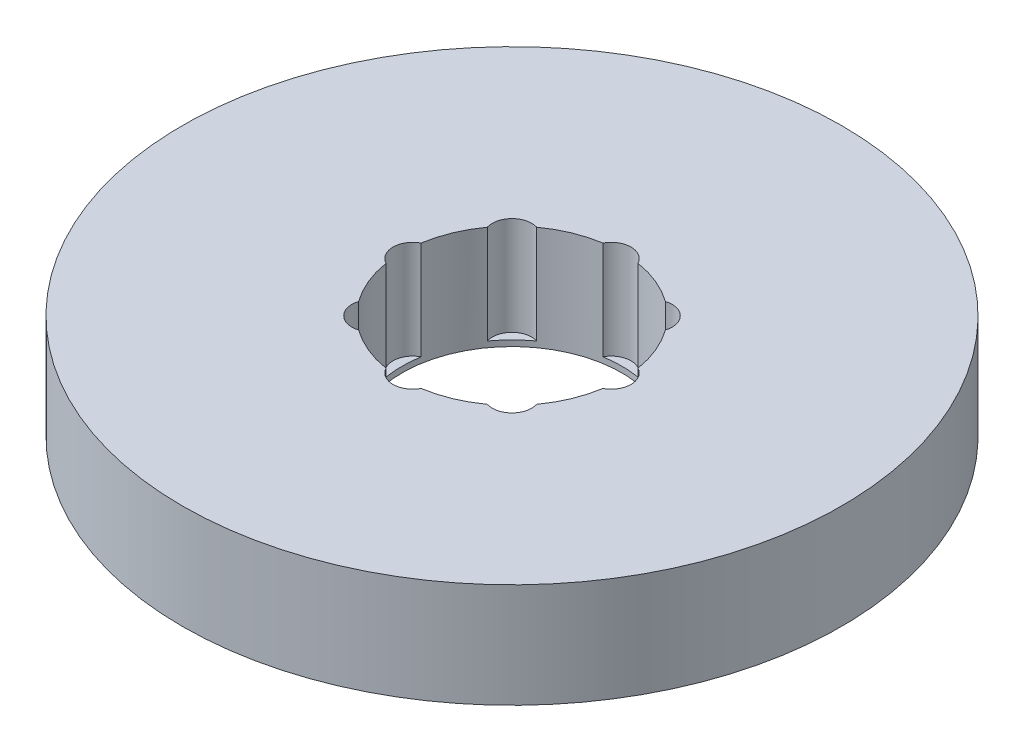
ISO-10303-21;
HEADER;
FILE_DESCRIPTION(('STEP AP214'),'2;1');
FILE_NAME('part.step','',(''),(''),'','','');
FILE_SCHEMA(('AUTOMOTIVE_DESIGN { 1 0 10303 214 1 1 1 1 }'));
ENDSEC;
DATA;
#1=APPLICATION_CONTEXT('core data for automotive mechanical design processes');
#2=APPLICATION_PROTOCOL_DEFINITION('international standard','automotive_design',2000,#1);
#3=PRODUCT_CONTEXT('',#1,'mechanical');
#4=PRODUCT('Part','Part','',(#3));
#5=PRODUCT_RELATED_PRODUCT_CATEGORY('part','',(#4));
#6=PRODUCT_DEFINITION_FORMATION('','',#4);
#7=PRODUCT_DEFINITION_CONTEXT('part definition',#1,'design');
#8=PRODUCT_DEFINITION('design','',#6,#7);
#9=PRODUCT_DEFINITION_SHAPE('','',#8);
#10=(LENGTH_UNIT() NAMED_UNIT(*) SI_UNIT(.MILLI.,.METRE.));
#11=(NAMED_UNIT(*) PLANE_ANGLE_UNIT() SI_UNIT($,.RADIAN.));
#12=(NAMED_UNIT(*) SI_UNIT($,.STERADIAN.) SOLID_ANGLE_UNIT());
#13=UNCERTAINTY_MEASURE_WITH_UNIT(LENGTH_MEASURE(1.E-05),#10,'distance_accuracy_value','');
#14=(GEOMETRIC_REPRESENTATION_CONTEXT(3) GLOBAL_UNCERTAINTY_ASSIGNED_CONTEXT((#13)) GLOBAL_UNIT_ASSIGNED_CONTEXT((#10,
#11,#12)) REPRESENTATION_CONTEXT('',''));
#15=CARTESIAN_POINT('',(0.,0.,0.));
#16=DIRECTION('',(0.,0.,1.));
#17=DIRECTION('',(1.,0.,0.));
#18=AXIS2_PLACEMENT_3D('',#15,#16,#17);
#19=CARTESIAN_POINT('',(0.,19.,0.));
#20=DIRECTION('',(0.,-1.,0.));
#21=DIRECTION('',(0.,0.,-1.));
#22=AXIS2_PLACEMENT_3D('',#19,#20,#21);
#23=CYLINDRICAL_SURFACE('',#22,60.);
#24=CARTESIAN_POINT('',(0.,19.,0.));
#25=DIRECTION('',(0.,1.,0.));
#26=DIRECTION('',(0.,0.,1.));
#27=AXIS2_PLACEMENT_3D('',#24,#25,#26);
#28=CIRCLE('',#27,60.);
#29=CARTESIAN_POINT('',(0.,19.,60.));
#30=VERTEX_POINT('',#29);
#31=EDGE_CURVE('E183',#30,#30,#28,.T.);
#32=ORIENTED_EDGE('',*,*,#31,.F.);
#33=EDGE_LOOP('',(#32));
#34=FACE_BOUND('',#33,.T.);
#35=CARTESIAN_POINT('',(0.,0.,0.));
#36=DIRECTION('',(0.,1.,0.));
#37=DIRECTION('',(0.,0.,1.));
#38=AXIS2_PLACEMENT_3D('',#35,#36,#37);
#39=CIRCLE('',#38,60.);
#40=CARTESIAN_POINT('',(0.,0.,60.));
#41=VERTEX_POINT('',#40);
#42=EDGE_CURVE('E182',#41,#41,#39,.T.);
#43=ORIENTED_EDGE('',*,*,#42,.T.);
#44=EDGE_LOOP('',(#43));
#45=FACE_BOUND('',#44,.T.);
#46=ADVANCED_FACE('F39',(#34,#45),#23,.T.);
#47=CARTESIAN_POINT('',(0.,19.,0.));
#48=DIRECTION('',(0.,1.,0.));
#49=DIRECTION('',(0.,0.,1.));
#50=AXIS2_PLACEMENT_3D('',#47,#48,#49);
#51=PLANE('',#50);
#52=CARTESIAN_POINT('',(0.,19.,18.0656059440609));
#53=DIRECTION('',(0.,1.,0.));
#54=DIRECTION('',(1.,0.,0.));
#55=AXIS2_PLACEMENT_3D('',#52,#53,#54);
#56=CIRCLE('',#55,3.60046366302594);
#57=CARTESIAN_POINT('',(-3.18492036893539,19.,19.7447786071037));
#58=VERTEX_POINT('',#57);
#59=CARTESIAN_POINT('',(3.18492036893552,19.,19.7447786071037));
#60=VERTEX_POINT('',#59);
#61=EDGE_CURVE('E256',#58,#60,#56,.T.);
#62=ORIENTED_EDGE('',*,*,#61,.F.);
#63=CARTESIAN_POINT('',(0.,19.,0.));
#64=DIRECTION('',(0.,1.,0.));
#65=DIRECTION('',(0.,0.,1.));
#66=AXIS2_PLACEMENT_3D('',#63,#64,#65);
#67=CIRCLE('',#66,20.);
#68=CARTESIAN_POINT('',(-11.7095880556967,19.,16.2137456365235));
#69=VERTEX_POINT('',#68);
#70=EDGE_CURVE('E175',#69,#58,#67,.T.);
#71=ORIENTED_EDGE('',*,*,#70,.F.);
#72=CARTESIAN_POINT('',(-12.7743124692895,19.,12.7743124692895));
#73=DIRECTION('',(0.,1.,0.));
#74=DIRECTION('',(0.707106781186549,0.,0.707106781186546));
#75=AXIS2_PLACEMENT_3D('',#72,#73,#74);
#76=CIRCLE('',#75,3.60046366302594);
#77=CARTESIAN_POINT('',(-16.2137456365235,19.,11.7095880556967));
#78=VERTEX_POINT('',#77);
#79=EDGE_CURVE('E152',#78,#69,#76,.T.);
#80=ORIENTED_EDGE('',*,*,#79,.F.);
#81=CARTESIAN_POINT('',(-19.7447786071037,19.,3.18492036893545));
#82=VERTEX_POINT('',#81);
#83=EDGE_CURVE('E168',#82,#78,#67,.T.);
#84=ORIENTED_EDGE('',*,*,#83,.F.);
#85=CARTESIAN_POINT('',(-18.0656059440609,19.,0.));
#86=DIRECTION('',(0.,1.,0.));
#87=DIRECTION('',(0.,0.,1.));
#88=AXIS2_PLACEMENT_3D('',#85,#86,#87);
#89=CIRCLE('',#88,3.60046366302594);
#90=CARTESIAN_POINT('',(-19.7447786071037,19.,-3.18492036893545));
#91=VERTEX_POINT('',#90);
#92=EDGE_CURVE('E205',#91,#82,#89,.T.);
#93=ORIENTED_EDGE('',*,*,#92,.F.);
#94=CARTESIAN_POINT('',(-16.2137456365237,19.,-11.7095880556965));
#95=VERTEX_POINT('',#94);
#96=EDGE_CURVE('E181',#95,#91,#67,.T.);
#97=ORIENTED_EDGE('',*,*,#96,.F.);
#98=CARTESIAN_POINT('',(-12.7743124692896,19.,-12.7743124692893));
#99=DIRECTION('',(0.,1.,0.));
#100=DIRECTION('',(-0.707106781186539,0.,0.707106781186556));
#101=AXIS2_PLACEMENT_3D('',#98,#99,#100);
#102=CIRCLE('',#101,3.60046366302594);
#103=CARTESIAN_POINT('',(-11.7095880556969,19.,-16.2137456365234));
#104=VERTEX_POINT('',#103);
#105=EDGE_CURVE('E453',#104,#95,#102,.T.);
#106=ORIENTED_EDGE('',*,*,#105,.F.);
#107=CARTESIAN_POINT('',(-3.18492036893566,19.,-19.7447786071037));
#108=VERTEX_POINT('',#107);
#109=EDGE_CURVE('E189',#108,#104,#67,.T.);
#110=ORIENTED_EDGE('',*,*,#109,.F.);
#111=CARTESIAN_POINT('',(-1.89227178085747E-13,19.,-18.0656059440609));
#112=DIRECTION('',(0.,1.,0.));
#113=DIRECTION('',(-1.,0.,0.));
#114=AXIS2_PLACEMENT_3D('',#111,#112,#113);
#115=CIRCLE('',#114,3.60046366302594);
#116=CARTESIAN_POINT('',(3.18492036893525,19.,-19.7447786071037));
#117=VERTEX_POINT('',#116);
#118=EDGE_CURVE('E462',#117,#108,#115,.T.);
#119=ORIENTED_EDGE('',*,*,#118,.F.);
#120=CARTESIAN_POINT('',(11.7095880556965,19.,-16.2137456365236));
#121=VERTEX_POINT('',#120);
#122=EDGE_CURVE('E197',#121,#117,#67,.T.);
#123=ORIENTED_EDGE('',*,*,#122,.F.);
#124=CARTESIAN_POINT('',(12.7743124692894,19.,-12.7743124692896));
#125=DIRECTION('',(0.,1.,0.));
#126=DIRECTION('',(-0.707106781186554,0.,-0.707106781186541));
#127=AXIS2_PLACEMENT_3D('',#124,#125,#126);
#128=CIRCLE('',#127,3.60046366302594);
#129=CARTESIAN_POINT('',(16.2137456365234,19.,-11.7095880556968));
#130=VERTEX_POINT('',#129);
#131=EDGE_CURVE('E470',#130,#121,#128,.T.);
#132=ORIENTED_EDGE('',*,*,#131,.F.);
#133=CARTESIAN_POINT('',(19.7447786071037,19.,-3.18492036893545));
#134=VERTEX_POINT('',#133);
#135=EDGE_CURVE('E489',#134,#130,#67,.T.);
#136=ORIENTED_EDGE('',*,*,#135,.F.);
#137=CARTESIAN_POINT('',(18.0656059440609,19.,0.));
#138=DIRECTION('',(0.,1.,0.));
#139=DIRECTION('',(0.,0.,-1.));
#140=AXIS2_PLACEMENT_3D('',#137,#138,#139);
#141=CIRCLE('',#140,3.60046366302594);
#142=CARTESIAN_POINT('',(19.7447786071037,19.,3.18492036893545));
#143=VERTEX_POINT('',#142);
#144=EDGE_CURVE('E476',#143,#134,#141,.T.);
#145=ORIENTED_EDGE('',*,*,#144,.F.);
#146=CARTESIAN_POINT('',(16.2137456365236,19.,11.7095880556966));
#147=VERTEX_POINT('',#146);
#148=EDGE_CURVE('E491',#147,#143,#67,.T.);
#149=ORIENTED_EDGE('',*,*,#148,.F.);
#150=CARTESIAN_POINT('',(12.7743124692895,19.,12.7743124692894));
#151=DIRECTION('',(0.,1.,0.));
#152=DIRECTION('',(0.707106781186544,0.,-0.707106781186551));
#153=AXIS2_PLACEMENT_3D('',#150,#151,#152);
#154=CIRCLE('',#153,3.60046366302594);
#155=CARTESIAN_POINT('',(11.7095880556968,19.,16.2137456365235));
#156=VERTEX_POINT('',#155);
#157=EDGE_CURVE('E475',#156,#147,#154,.T.);
#158=ORIENTED_EDGE('',*,*,#157,.F.);
#159=EDGE_CURVE('E190',#60,#156,#67,.T.);
#160=ORIENTED_EDGE('',*,*,#159,.F.);
#161=EDGE_LOOP('',(#62,#71,#80,#84,#93,#97,#106,#110,#119,#123,#132,#136,#145,#149,#158,#160));
#162=FACE_BOUND('',#161,.T.);
#163=ORIENTED_EDGE('',*,*,#31,.T.);
#164=EDGE_LOOP('',(#163));
#165=FACE_BOUND('',#164,.T.);
#166=ADVANCED_FACE('F170',(#162,#165),#51,.T.);
#167=CARTESIAN_POINT('',(0.,0.,0.));
#168=DIRECTION('',(0.,1.,0.));
#169=DIRECTION('',(0.,0.,1.));
#170=AXIS2_PLACEMENT_3D('',#167,#168,#169);
#171=PLANE('',#170);
#172=CARTESIAN_POINT('',(0.,0.,0.));
#173=DIRECTION('',(0.,1.,0.));
#174=DIRECTION('',(0.,0.,1.));
#175=AXIS2_PLACEMENT_3D('',#172,#173,#174);
#176=CIRCLE('',#175,20.);
#177=CARTESIAN_POINT('',(0.,0.,20.));
#178=VERTEX_POINT('',#177);
#179=EDGE_CURVE('E191',#178,#178,#176,.T.);
#180=ORIENTED_EDGE('',*,*,#179,.T.);
#181=EDGE_LOOP('',(#180));
#182=FACE_BOUND('',#181,.T.);
#183=ORIENTED_EDGE('',*,*,#42,.F.);
#184=EDGE_LOOP('',(#183));
#185=FACE_BOUND('',#184,.T.);
#186=ADVANCED_FACE('F277',(#182,#185),#171,.F.);
#187=CARTESIAN_POINT('',(0.,19.,0.));
#188=DIRECTION('',(0.,-1.,0.));
#189=DIRECTION('',(0.,0.,-1.));
#190=AXIS2_PLACEMENT_3D('',#187,#188,#189);
#191=CYLINDRICAL_SURFACE('',#190,20.);
#192=DIRECTION('',(0.,1.,0.));
#193=VECTOR('',#192,1.);
#194=CARTESIAN_POINT('',(-3.18492036893538,10.0312920717219,19.7447786071037));
#195=LINE('',#194,#193);
#196=CARTESIAN_POINT('',(-3.18492036893539,1.06258414344381,19.7447786071037));
#197=VERTEX_POINT('',#196);
#198=EDGE_CURVE('E11',#197,#58,#195,.T.);
#199=ORIENTED_EDGE('',*,*,#198,.F.);
#200=CARTESIAN_POINT('',(0.,1.06258414344381,0.));
#201=DIRECTION('',(0.,1.,0.));
#202=DIRECTION('',(0.,0.,1.));
#203=AXIS2_PLACEMENT_3D('',#200,#201,#202);
#204=CIRCLE('',#203,20.);
#205=CARTESIAN_POINT('',(3.18492036893552,1.06258414344381,19.7447786071037));
#206=VERTEX_POINT('',#205);
#207=EDGE_CURVE('E251',#197,#206,#204,.T.);
#208=ORIENTED_EDGE('',*,*,#207,.T.);
#209=DIRECTION('',(0.,1.,0.));
#210=VECTOR('',#209,1.);
#211=CARTESIAN_POINT('',(3.18492036893552,10.0312920717219,19.7447786071037));
#212=LINE('',#211,#210);
#213=EDGE_CURVE('E46',#60,#206,#212,.F.);
#214=ORIENTED_EDGE('',*,*,#213,.F.);
#215=ORIENTED_EDGE('',*,*,#159,.T.);
#216=DIRECTION('',(0.,1.,0.));
#217=VECTOR('',#216,1.);
#218=CARTESIAN_POINT('',(11.7095880556968,10.0312920717219,16.2137456365235));
#219=LINE('',#218,#217);
#220=CARTESIAN_POINT('',(11.7095880556968,1.06258414344381,16.2137456365235));
#221=VERTEX_POINT('',#220);
#222=EDGE_CURVE('E253',#221,#156,#219,.T.);
#223=ORIENTED_EDGE('',*,*,#222,.F.);
#224=CARTESIAN_POINT('',(0.,1.06258414344381,0.));
#225=DIRECTION('',(0.,1.,0.));
#226=DIRECTION('',(0.,0.,1.));
#227=AXIS2_PLACEMENT_3D('',#224,#225,#226);
#228=CIRCLE('',#227,20.);
#229=CARTESIAN_POINT('',(16.2137456365236,1.06258414344381,11.7095880556966));
#230=VERTEX_POINT('',#229);
#231=EDGE_CURVE('E246',#221,#230,#228,.T.);
#232=ORIENTED_EDGE('',*,*,#231,.T.);
#233=DIRECTION('',(0.,1.,0.));
#234=VECTOR('',#233,1.);
#235=CARTESIAN_POINT('',(16.2137456365236,10.0312920717219,11.7095880556966));
#236=LINE('',#235,#234);
#237=EDGE_CURVE('E248',#147,#230,#236,.F.);
#238=ORIENTED_EDGE('',*,*,#237,.F.);
#239=ORIENTED_EDGE('',*,*,#148,.T.);
#240=DIRECTION('',(0.,1.,0.));
#241=VECTOR('',#240,1.);
#242=CARTESIAN_POINT('',(19.7447786071037,10.0312920717219,3.18492036893545));
#243=LINE('',#242,#241);
#244=CARTESIAN_POINT('',(19.7447786071037,1.06258414344381,3.18492036893545));
#245=VERTEX_POINT('',#244);
#246=EDGE_CURVE('E243',#245,#143,#243,.T.);
#247=ORIENTED_EDGE('',*,*,#246,.F.);
#248=CARTESIAN_POINT('',(0.,1.06258414344381,0.));
#249=DIRECTION('',(0.,1.,0.));
#250=DIRECTION('',(0.,0.,1.));
#251=AXIS2_PLACEMENT_3D('',#248,#249,#250);
#252=CIRCLE('',#251,20.);
#253=CARTESIAN_POINT('',(19.7447786071037,1.06258414344381,-3.18492036893545));
#254=VERTEX_POINT('',#253);
#255=EDGE_CURVE('E236',#245,#254,#252,.T.);
#256=ORIENTED_EDGE('',*,*,#255,.T.);
#257=DIRECTION('',(0.,1.,0.));
#258=VECTOR('',#257,1.);
#259=CARTESIAN_POINT('',(19.7447786071037,10.0312920717219,-3.18492036893545));
#260=LINE('',#259,#258);
#261=EDGE_CURVE('E241',#134,#254,#260,.F.);
#262=ORIENTED_EDGE('',*,*,#261,.F.);
#263=ORIENTED_EDGE('',*,*,#135,.T.);
#264=DIRECTION('',(0.,1.,0.));
#265=VECTOR('',#264,1.);
#266=CARTESIAN_POINT('',(16.2137456365234,10.0312920717219,-11.7095880556968));
#267=LINE('',#266,#265);
#268=CARTESIAN_POINT('',(16.2137456365234,1.06258414344381,-11.7095880556968));
#269=VERTEX_POINT('',#268);
#270=EDGE_CURVE('E237',#269,#130,#267,.T.);
#271=ORIENTED_EDGE('',*,*,#270,.F.);
#272=CARTESIAN_POINT('',(0.,1.06258414344381,0.));
#273=DIRECTION('',(0.,1.,0.));
#274=DIRECTION('',(0.,0.,1.));
#275=AXIS2_PLACEMENT_3D('',#272,#273,#274);
#276=CIRCLE('',#275,20.);
#277=CARTESIAN_POINT('',(11.7095880556965,1.06258414344381,-16.2137456365236));
#278=VERTEX_POINT('',#277);
#279=EDGE_CURVE('E229',#269,#278,#276,.T.);
#280=ORIENTED_EDGE('',*,*,#279,.T.);
#281=DIRECTION('',(0.,1.,0.));
#282=VECTOR('',#281,1.);
#283=CARTESIAN_POINT('',(11.7095880556965,10.0312920717219,-16.2137456365236));
#284=LINE('',#283,#282);
#285=EDGE_CURVE('E232',#121,#278,#284,.F.);
#286=ORIENTED_EDGE('',*,*,#285,.F.);
#287=ORIENTED_EDGE('',*,*,#122,.T.);
#288=DIRECTION('',(0.,1.,0.));
#289=VECTOR('',#288,1.);
#290=CARTESIAN_POINT('',(3.18492036893524,10.0312920717219,-19.7447786071037));
#291=LINE('',#290,#289);
#292=CARTESIAN_POINT('',(3.18492036893525,1.06258414344381,-19.7447786071037));
#293=VERTEX_POINT('',#292);
#294=EDGE_CURVE('E227',#293,#117,#291,.T.);
#295=ORIENTED_EDGE('',*,*,#294,.F.);
#296=CARTESIAN_POINT('',(0.,1.06258414344381,0.));
#297=DIRECTION('',(0.,1.,0.));
#298=DIRECTION('',(0.,0.,1.));
#299=AXIS2_PLACEMENT_3D('',#296,#297,#298);
#300=CIRCLE('',#299,20.);
#301=CARTESIAN_POINT('',(-3.18492036893566,1.06258414344381,-19.7447786071037));
#302=VERTEX_POINT('',#301);
#303=EDGE_CURVE('E225',#293,#302,#300,.T.);
#304=ORIENTED_EDGE('',*,*,#303,.T.);
#305=DIRECTION('',(0.,1.,0.));
#306=VECTOR('',#305,1.);
#307=CARTESIAN_POINT('',(-3.18492036893566,10.0312920717219,-19.7447786071037));
#308=LINE('',#307,#306);
#309=EDGE_CURVE('E223',#108,#302,#308,.F.);
#310=ORIENTED_EDGE('',*,*,#309,.F.);
#311=ORIENTED_EDGE('',*,*,#109,.T.);
#312=DIRECTION('',(0.,1.,0.));
#313=VECTOR('',#312,1.);
#314=CARTESIAN_POINT('',(-11.7095880556969,10.0312920717219,-16.2137456365234));
#315=LINE('',#314,#313);
#316=CARTESIAN_POINT('',(-11.7095880556969,1.06258414344381,-16.2137456365234));
#317=VERTEX_POINT('',#316);
#318=EDGE_CURVE('E219',#317,#104,#315,.T.);
#319=ORIENTED_EDGE('',*,*,#318,.F.);
#320=CARTESIAN_POINT('',(0.,1.06258414344381,0.));
#321=DIRECTION('',(0.,1.,0.));
#322=DIRECTION('',(0.,0.,1.));
#323=AXIS2_PLACEMENT_3D('',#320,#321,#322);
#324=CIRCLE('',#323,20.);
#325=CARTESIAN_POINT('',(-16.2137456365237,1.06258414344381,-11.7095880556965));
#326=VERTEX_POINT('',#325);
#327=EDGE_CURVE('E159',#317,#326,#324,.T.);
#328=ORIENTED_EDGE('',*,*,#327,.T.);
#329=DIRECTION('',(0.,1.,0.));
#330=VECTOR('',#329,1.);
#331=CARTESIAN_POINT('',(-16.2137456365237,10.0312920717219,-11.7095880556965));
#332=LINE('',#331,#330);
#333=EDGE_CURVE('E220',#95,#326,#332,.F.);
#334=ORIENTED_EDGE('',*,*,#333,.F.);
#335=ORIENTED_EDGE('',*,*,#96,.T.);
#336=DIRECTION('',(0.,1.,0.));
#337=VECTOR('',#336,1.);
#338=CARTESIAN_POINT('',(-19.7447786071037,10.0312920717219,-3.18492036893545));
#339=LINE('',#338,#337);
#340=CARTESIAN_POINT('',(-19.7447786071037,1.06258414344381,-3.18492036893545));
#341=VERTEX_POINT('',#340);
#342=EDGE_CURVE('E209',#341,#91,#339,.T.);
#343=ORIENTED_EDGE('',*,*,#342,.F.);
#344=CARTESIAN_POINT('',(0.,1.06258414344381,0.));
#345=DIRECTION('',(0.,1.,0.));
#346=DIRECTION('',(0.,0.,1.));
#347=AXIS2_PLACEMENT_3D('',#344,#345,#346);
#348=CIRCLE('',#347,20.);
#349=CARTESIAN_POINT('',(-19.7447786071037,1.06258414344381,3.18492036893545));
#350=VERTEX_POINT('',#349);
#351=EDGE_CURVE('E206',#341,#350,#348,.T.);
#352=ORIENTED_EDGE('',*,*,#351,.T.);
#353=DIRECTION('',(0.,1.,0.));
#354=VECTOR('',#353,1.);
#355=CARTESIAN_POINT('',(-19.7447786071037,10.0312920717219,3.18492036893545));
#356=LINE('',#355,#354);
#357=EDGE_CURVE('E179',#82,#350,#356,.F.);
#358=ORIENTED_EDGE('',*,*,#357,.F.);
#359=ORIENTED_EDGE('',*,*,#83,.T.);
#360=DIRECTION('',(0.,1.,0.));
#361=VECTOR('',#360,1.);
#362=CARTESIAN_POINT('',(-16.2137456365235,10.0312920717219,11.7095880556967));
#363=LINE('',#362,#361);
#364=CARTESIAN_POINT('',(-16.2137456365235,1.06258414344381,11.7095880556967));
#365=VERTEX_POINT('',#364);
#366=EDGE_CURVE('E147',#365,#78,#363,.T.);
#367=ORIENTED_EDGE('',*,*,#366,.F.);
#368=CARTESIAN_POINT('',(0.,1.06258414344381,0.));
#369=DIRECTION('',(0.,1.,0.));
#370=DIRECTION('',(0.,0.,1.));
#371=AXIS2_PLACEMENT_3D('',#368,#369,#370);
#372=CIRCLE('',#371,20.);
#373=CARTESIAN_POINT('',(-11.7095880556967,1.06258414344381,16.2137456365235));
#374=VERTEX_POINT('',#373);
#375=EDGE_CURVE('E215',#365,#374,#372,.T.);
#376=ORIENTED_EDGE('',*,*,#375,.T.);
#377=DIRECTION('',(0.,1.,0.));
#378=VECTOR('',#377,1.);
#379=CARTESIAN_POINT('',(-11.7095880556967,10.0312920717219,16.2137456365235));
#380=LINE('',#379,#378);
#381=EDGE_CURVE('E161',#69,#374,#380,.F.);
#382=ORIENTED_EDGE('',*,*,#381,.F.);
#383=ORIENTED_EDGE('',*,*,#70,.T.);
#384=EDGE_LOOP('',(#199,#208,#214,#215,#223,#232,#238,#239,#247,#256,#262,#263,#271,#280,#286,
#287,#295,#304,#310,#311,#319,#328,#334,#335,#343,#352,#358,#359,#367,#376,#382,#383));
#385=FACE_BOUND('',#384,.T.);
#386=ORIENTED_EDGE('',*,*,#179,.F.);
#387=EDGE_LOOP('',(#386));
#388=FACE_BOUND('',#387,.T.);
#389=ADVANCED_FACE('F176',(#385,#388),#191,.F.);
#390=CARTESIAN_POINT('',(-18.0656059440609,1.06258414344381,0.));
#391=DIRECTION('',(0.,1.,0.));
#392=DIRECTION('',(0.,0.,1.));
#393=AXIS2_PLACEMENT_3D('',#390,#391,#392);
#394=CYLINDRICAL_SURFACE('',#393,3.60046366302594);
#395=ORIENTED_EDGE('',*,*,#342,.T.);
#396=ORIENTED_EDGE('',*,*,#92,.T.);
#397=ORIENTED_EDGE('',*,*,#357,.T.);
#398=CARTESIAN_POINT('',(-18.0656059440609,1.06258414344381,0.));
#399=DIRECTION('',(0.,1.,0.));
#400=DIRECTION('',(0.,0.,1.));
#401=AXIS2_PLACEMENT_3D('',#398,#399,#400);
#402=CIRCLE('',#401,3.60046366302594);
#403=EDGE_CURVE('E200',#341,#350,#402,.T.);
#404=ORIENTED_EDGE('',*,*,#403,.F.);
#405=EDGE_LOOP('',(#395,#396,#397,#404));
#406=FACE_BOUND('',#405,.T.);
#407=ADVANCED_FACE('F286',(#406),#394,.F.);
#408=CARTESIAN_POINT('',(-18.0656059440609,1.06258414344381,0.));
#409=DIRECTION('',(0.,1.,0.));
#410=DIRECTION('',(0.,0.,1.));
#411=AXIS2_PLACEMENT_3D('',#408,#409,#410);
#412=PLANE('',#411);
#413=ORIENTED_EDGE('',*,*,#403,.T.);
#414=ORIENTED_EDGE('',*,*,#351,.F.);
#415=EDGE_LOOP('',(#413,#414));
#416=FACE_BOUND('',#415,.T.);
#417=ADVANCED_FACE('F289',(#416),#412,.T.);
#418=CARTESIAN_POINT('',(-12.7743124692895,1.06258414344381,12.7743124692895));
#419=DIRECTION('',(0.,1.,0.));
#420=DIRECTION('',(0.,0.,1.));
#421=AXIS2_PLACEMENT_3D('',#418,#419,#420);
#422=CYLINDRICAL_SURFACE('',#421,3.60046366302594);
#423=ORIENTED_EDGE('',*,*,#366,.T.);
#424=ORIENTED_EDGE('',*,*,#79,.T.);
#425=ORIENTED_EDGE('',*,*,#381,.T.);
#426=CARTESIAN_POINT('',(-12.7743124692895,1.06258414344381,12.7743124692895));
#427=DIRECTION('',(0.,1.,0.));
#428=DIRECTION('',(0.707106781186549,0.,0.707106781186546));
#429=AXIS2_PLACEMENT_3D('',#426,#427,#428);
#430=CIRCLE('',#429,3.60046366302594);
#431=EDGE_CURVE('E156',#365,#374,#430,.T.);
#432=ORIENTED_EDGE('',*,*,#431,.F.);
#433=EDGE_LOOP('',(#423,#424,#425,#432));
#434=FACE_BOUND('',#433,.T.);
#435=ADVANCED_FACE('F155',(#434),#422,.F.);
#436=CARTESIAN_POINT('',(-12.7743124692895,1.06258414344381,12.7743124692895));
#437=DIRECTION('',(0.,1.,0.));
#438=DIRECTION('',(0.707106781186549,0.,0.707106781186546));
#439=AXIS2_PLACEMENT_3D('',#436,#437,#438);
#440=PLANE('',#439);
#441=ORIENTED_EDGE('',*,*,#431,.T.);
#442=ORIENTED_EDGE('',*,*,#375,.F.);
#443=EDGE_LOOP('',(#441,#442));
#444=FACE_BOUND('',#443,.T.);
#445=ADVANCED_FACE('F300',(#444),#440,.T.);
#446=CARTESIAN_POINT('',(-12.7743124692896,1.06258414344381,-12.7743124692893));
#447=DIRECTION('',(0.,1.,0.));
#448=DIRECTION('',(0.,0.,1.));
#449=AXIS2_PLACEMENT_3D('',#446,#447,#448);
#450=CYLINDRICAL_SURFACE('',#449,3.60046366302594);
#451=ORIENTED_EDGE('',*,*,#318,.T.);
#452=ORIENTED_EDGE('',*,*,#105,.T.);
#453=ORIENTED_EDGE('',*,*,#333,.T.);
#454=CARTESIAN_POINT('',(-12.7743124692896,1.06258414344381,-12.7743124692893));
#455=DIRECTION('',(0.,1.,0.));
#456=DIRECTION('',(-0.707106781186539,0.,0.707106781186556));
#457=AXIS2_PLACEMENT_3D('',#454,#455,#456);
#458=CIRCLE('',#457,3.60046366302594);
#459=EDGE_CURVE('E454',#317,#326,#458,.T.);
#460=ORIENTED_EDGE('',*,*,#459,.F.);
#461=EDGE_LOOP('',(#451,#452,#453,#460));
#462=FACE_BOUND('',#461,.T.);
#463=ADVANCED_FACE('F299',(#462),#450,.F.);
#464=CARTESIAN_POINT('',(-12.7743124692896,1.06258414344381,-12.7743124692893));
#465=DIRECTION('',(0.,1.,0.));
#466=DIRECTION('',(-0.707106781186539,0.,0.707106781186556));
#467=AXIS2_PLACEMENT_3D('',#464,#465,#466);
#468=PLANE('',#467);
#469=ORIENTED_EDGE('',*,*,#459,.T.);
#470=ORIENTED_EDGE('',*,*,#327,.F.);
#471=EDGE_LOOP('',(#469,#470));
#472=FACE_BOUND('',#471,.T.);
#473=ADVANCED_FACE('F379',(#472),#468,.T.);
#474=CARTESIAN_POINT('',(-1.89227178085747E-13,1.06258414344381,-18.0656059440609));
#475=DIRECTION('',(0.,1.,0.));
#476=DIRECTION('',(0.,0.,1.));
#477=AXIS2_PLACEMENT_3D('',#474,#475,#476);
#478=CYLINDRICAL_SURFACE('',#477,3.60046366302594);
#479=ORIENTED_EDGE('',*,*,#294,.T.);
#480=ORIENTED_EDGE('',*,*,#118,.T.);
#481=ORIENTED_EDGE('',*,*,#309,.T.);
#482=CARTESIAN_POINT('',(-1.89227178085747E-13,1.06258414344381,-18.0656059440609));
#483=DIRECTION('',(0.,1.,0.));
#484=DIRECTION('',(-1.,0.,0.));
#485=AXIS2_PLACEMENT_3D('',#482,#483,#484);
#486=CIRCLE('',#485,3.60046366302594);
#487=EDGE_CURVE('E465',#293,#302,#486,.T.);
#488=ORIENTED_EDGE('',*,*,#487,.F.);
#489=EDGE_LOOP('',(#479,#480,#481,#488));
#490=FACE_BOUND('',#489,.T.);
#491=ADVANCED_FACE('F371',(#490),#478,.F.);
#492=CARTESIAN_POINT('',(-1.89227178085747E-13,1.06258414344381,-18.0656059440609));
#493=DIRECTION('',(0.,1.,0.));
#494=DIRECTION('',(-1.,0.,0.));
#495=AXIS2_PLACEMENT_3D('',#492,#493,#494);
#496=PLANE('',#495);
#497=ORIENTED_EDGE('',*,*,#487,.T.);
#498=ORIENTED_EDGE('',*,*,#303,.F.);
#499=EDGE_LOOP('',(#497,#498));
#500=FACE_BOUND('',#499,.T.);
#501=ADVANCED_FACE('F308',(#500),#496,.T.);
#502=CARTESIAN_POINT('',(12.7743124692894,1.06258414344381,-12.7743124692896));
#503=DIRECTION('',(0.,1.,0.));
#504=DIRECTION('',(0.,0.,1.));
#505=AXIS2_PLACEMENT_3D('',#502,#503,#504);
#506=CYLINDRICAL_SURFACE('',#505,3.60046366302594);
#507=ORIENTED_EDGE('',*,*,#270,.T.);
#508=ORIENTED_EDGE('',*,*,#131,.T.);
#509=ORIENTED_EDGE('',*,*,#285,.T.);
#510=CARTESIAN_POINT('',(12.7743124692894,1.06258414344381,-12.7743124692896));
#511=DIRECTION('',(0.,1.,0.));
#512=DIRECTION('',(-0.707106781186554,0.,-0.707106781186541));
#513=AXIS2_PLACEMENT_3D('',#510,#511,#512);
#514=CIRCLE('',#513,3.60046366302594);
#515=EDGE_CURVE('E477',#269,#278,#514,.T.);
#516=ORIENTED_EDGE('',*,*,#515,.F.);
#517=EDGE_LOOP('',(#507,#508,#509,#516));
#518=FACE_BOUND('',#517,.T.);
#519=ADVANCED_FACE('F305',(#518),#506,.F.);
#520=CARTESIAN_POINT('',(12.7743124692894,1.06258414344381,-12.7743124692896));
#521=DIRECTION('',(0.,1.,0.));
#522=DIRECTION('',(-0.707106781186554,0.,-0.707106781186541));
#523=AXIS2_PLACEMENT_3D('',#520,#521,#522);
#524=PLANE('',#523);
#525=ORIENTED_EDGE('',*,*,#515,.T.);
#526=ORIENTED_EDGE('',*,*,#279,.F.);
#527=EDGE_LOOP('',(#525,#526));
#528=FACE_BOUND('',#527,.T.);
#529=ADVANCED_FACE('F304',(#528),#524,.T.);
#530=CARTESIAN_POINT('',(18.0656059440609,1.06258414344381,0.));
#531=DIRECTION('',(0.,1.,0.));
#532=DIRECTION('',(0.,0.,1.));
#533=AXIS2_PLACEMENT_3D('',#530,#531,#532);
#534=CYLINDRICAL_SURFACE('',#533,3.60046366302594);
#535=ORIENTED_EDGE('',*,*,#246,.T.);
#536=ORIENTED_EDGE('',*,*,#144,.T.);
#537=ORIENTED_EDGE('',*,*,#261,.T.);
#538=CARTESIAN_POINT('',(18.0656059440609,1.06258414344381,0.));
#539=DIRECTION('',(0.,1.,0.));
#540=DIRECTION('',(0.,0.,-1.));
#541=AXIS2_PLACEMENT_3D('',#538,#539,#540);
#542=CIRCLE('',#541,3.60046366302594);
#543=EDGE_CURVE('E478',#245,#254,#542,.T.);
#544=ORIENTED_EDGE('',*,*,#543,.F.);
#545=EDGE_LOOP('',(#535,#536,#537,#544));
#546=FACE_BOUND('',#545,.T.);
#547=ADVANCED_FACE('F309',(#546),#534,.F.);
#548=CARTESIAN_POINT('',(18.0656059440609,1.06258414344381,0.));
#549=DIRECTION('',(0.,1.,0.));
#550=DIRECTION('',(0.,0.,-1.));
#551=AXIS2_PLACEMENT_3D('',#548,#549,#550);
#552=PLANE('',#551);
#553=ORIENTED_EDGE('',*,*,#543,.T.);
#554=ORIENTED_EDGE('',*,*,#255,.F.);
#555=EDGE_LOOP('',(#553,#554));
#556=FACE_BOUND('',#555,.T.);
#557=ADVANCED_FACE('F314',(#556),#552,.T.);
#558=CARTESIAN_POINT('',(12.7743124692895,1.06258414344381,12.7743124692894));
#559=DIRECTION('',(0.,1.,0.));
#560=DIRECTION('',(0.,0.,1.));
#561=AXIS2_PLACEMENT_3D('',#558,#559,#560);
#562=CYLINDRICAL_SURFACE('',#561,3.60046366302594);
#563=ORIENTED_EDGE('',*,*,#222,.T.);
#564=ORIENTED_EDGE('',*,*,#157,.T.);
#565=ORIENTED_EDGE('',*,*,#237,.T.);
#566=CARTESIAN_POINT('',(12.7743124692895,1.06258414344381,12.7743124692894));
#567=DIRECTION('',(0.,1.,0.));
#568=DIRECTION('',(0.707106781186544,0.,-0.707106781186551));
#569=AXIS2_PLACEMENT_3D('',#566,#567,#568);
#570=CIRCLE('',#569,3.60046366302594);
#571=EDGE_CURVE('E56',#221,#230,#570,.T.);
#572=ORIENTED_EDGE('',*,*,#571,.F.);
#573=EDGE_LOOP('',(#563,#564,#565,#572));
#574=FACE_BOUND('',#573,.T.);
#575=ADVANCED_FACE('F318',(#574),#562,.F.);
#576=CARTESIAN_POINT('',(12.7743124692895,1.06258414344381,12.7743124692894));
#577=DIRECTION('',(0.,1.,0.));
#578=DIRECTION('',(0.707106781186544,0.,-0.707106781186551));
#579=AXIS2_PLACEMENT_3D('',#576,#577,#578);
#580=PLANE('',#579);
#581=ORIENTED_EDGE('',*,*,#571,.T.);
#582=ORIENTED_EDGE('',*,*,#231,.F.);
#583=EDGE_LOOP('',(#581,#582));
#584=FACE_BOUND('',#583,.T.);
#585=ADVANCED_FACE('F270',(#584),#580,.T.);
#586=CARTESIAN_POINT('',(0.,1.06258414344381,18.0656059440609));
#587=DIRECTION('',(0.,1.,0.));
#588=DIRECTION('',(0.,0.,1.));
#589=AXIS2_PLACEMENT_3D('',#586,#587,#588);
#590=CYLINDRICAL_SURFACE('',#589,3.60046366302594);
#591=ORIENTED_EDGE('',*,*,#198,.T.);
#592=ORIENTED_EDGE('',*,*,#61,.T.);
#593=ORIENTED_EDGE('',*,*,#213,.T.);
#594=CARTESIAN_POINT('',(0.,1.06258414344381,18.0656059440609));
#595=DIRECTION('',(0.,1.,0.));
#596=DIRECTION('',(1.,0.,0.));
#597=AXIS2_PLACEMENT_3D('',#594,#595,#596);
#598=CIRCLE('',#597,3.60046366302594);
#599=EDGE_CURVE('E55',#197,#206,#598,.T.);
#600=ORIENTED_EDGE('',*,*,#599,.F.);
#601=EDGE_LOOP('',(#591,#592,#593,#600));
#602=FACE_BOUND('',#601,.T.);
#603=ADVANCED_FACE('F260',(#602),#590,.F.);
#604=CARTESIAN_POINT('',(0.,1.06258414344381,18.0656059440609));
#605=DIRECTION('',(0.,1.,0.));
#606=DIRECTION('',(1.,0.,0.));
#607=AXIS2_PLACEMENT_3D('',#604,#605,#606);
#608=PLANE('',#607);
#609=ORIENTED_EDGE('',*,*,#599,.T.);
#610=ORIENTED_EDGE('',*,*,#207,.F.);
#611=EDGE_LOOP('',(#609,#610));
#612=FACE_BOUND('',#611,.T.);
#613=ADVANCED_FACE('F261',(#612),#608,.T.);
#614=CLOSED_SHELL('',(#46,#166,#186,#389,#407,#417,#435,#445,#463,#473,#491,#501,#519,#529,#547,
#557,#575,#585,#603,#613));
#615=MANIFOLD_SOLID_BREP('B2',#614);
#616=ADVANCED_BREP_SHAPE_REPRESENTATION('',(#18,#615),#14);
#617=SHAPE_DEFINITION_REPRESENTATION(#9,#616);
ENDSEC;
END-ISO-10303-21;
